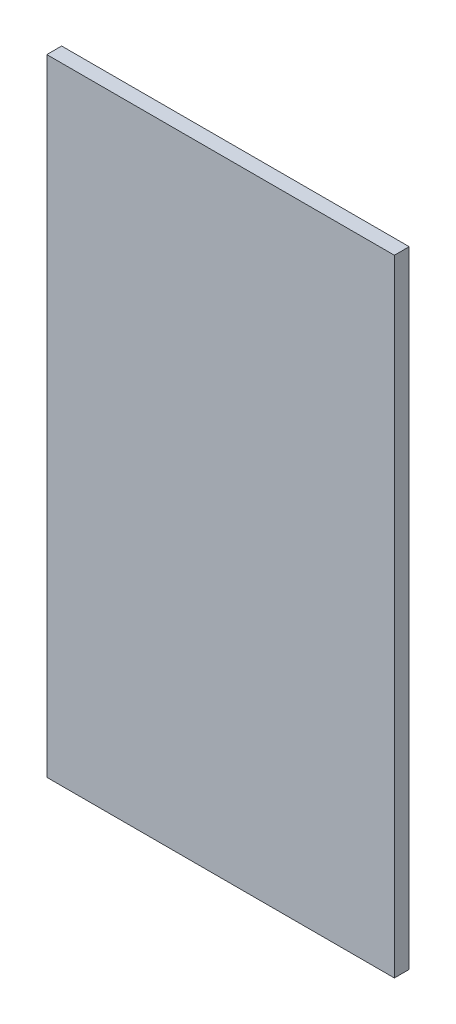
ISO-10303-21;
HEADER;
FILE_DESCRIPTION(('STEP AP214'),'2;1');
FILE_NAME('part.step','',(''),(''),'','','');
FILE_SCHEMA(('AUTOMOTIVE_DESIGN { 1 0 10303 214 1 1 1 1 }'));
ENDSEC;
DATA;
#1=APPLICATION_CONTEXT('core data for automotive mechanical design processes');
#2=APPLICATION_PROTOCOL_DEFINITION('international standard','automotive_design',2000,#1);
#3=PRODUCT_CONTEXT('',#1,'mechanical');
#4=PRODUCT('Part','Part','',(#3));
#5=PRODUCT_RELATED_PRODUCT_CATEGORY('part','',(#4));
#6=PRODUCT_DEFINITION_FORMATION('','',#4);
#7=PRODUCT_DEFINITION_CONTEXT('part definition',#1,'design');
#8=PRODUCT_DEFINITION('design','',#6,#7);
#9=PRODUCT_DEFINITION_SHAPE('','',#8);
#10=(LENGTH_UNIT() NAMED_UNIT(*) SI_UNIT(.MILLI.,.METRE.));
#11=(NAMED_UNIT(*) PLANE_ANGLE_UNIT() SI_UNIT($,.RADIAN.));
#12=(NAMED_UNIT(*) SI_UNIT($,.STERADIAN.) SOLID_ANGLE_UNIT());
#13=UNCERTAINTY_MEASURE_WITH_UNIT(LENGTH_MEASURE(1.E-05),#10,'distance_accuracy_value','');
#14=(GEOMETRIC_REPRESENTATION_CONTEXT(3) GLOBAL_UNCERTAINTY_ASSIGNED_CONTEXT((#13)) GLOBAL_UNIT_ASSIGNED_CONTEXT((#10,
#11,#12)) REPRESENTATION_CONTEXT('',''));
#15=CARTESIAN_POINT('',(0.,0.,0.));
#16=DIRECTION('',(0.,0.,1.));
#17=DIRECTION('',(1.,0.,0.));
#18=AXIS2_PLACEMENT_3D('',#15,#16,#17);
#19=CARTESIAN_POINT('',(105.5,-190.,9.));
#20=DIRECTION('',(-1.,0.,0.));
#21=DIRECTION('',(0.,0.,1.));
#22=AXIS2_PLACEMENT_3D('',#19,#20,#21);
#23=PLANE('',#22);
#24=DIRECTION('',(0.,1.,0.));
#25=VECTOR('',#24,1.);
#26=CARTESIAN_POINT('',(105.5,-190.,0.));
#27=LINE('',#26,#25);
#28=CARTESIAN_POINT('',(105.5,-190.,0.));
#29=VERTEX_POINT('',#28);
#30=CARTESIAN_POINT('',(105.5,190.,0.));
#31=VERTEX_POINT('',#30);
#32=EDGE_CURVE('E100',#29,#31,#27,.T.);
#33=ORIENTED_EDGE('',*,*,#32,.T.);
#34=DIRECTION('',(0.,0.,-1.));
#35=VECTOR('',#34,1.);
#36=CARTESIAN_POINT('',(105.5,190.,9.));
#37=LINE('',#36,#35);
#38=CARTESIAN_POINT('',(105.5,190.,9.));
#39=VERTEX_POINT('',#38);
#40=EDGE_CURVE('E11',#39,#31,#37,.T.);
#41=ORIENTED_EDGE('',*,*,#40,.F.);
#42=DIRECTION('',(0.,1.,0.));
#43=VECTOR('',#42,1.);
#44=CARTESIAN_POINT('',(105.5,-190.,9.));
#45=LINE('',#44,#43);
#46=CARTESIAN_POINT('',(105.5,-190.,9.));
#47=VERTEX_POINT('',#46);
#48=EDGE_CURVE('E88',#47,#39,#45,.T.);
#49=ORIENTED_EDGE('',*,*,#48,.F.);
#50=DIRECTION('',(0.,0.,-1.));
#51=VECTOR('',#50,1.);
#52=CARTESIAN_POINT('',(105.5,-190.,9.));
#53=LINE('',#52,#51);
#54=EDGE_CURVE('E96',#47,#29,#53,.T.);
#55=ORIENTED_EDGE('',*,*,#54,.T.);
#56=EDGE_LOOP('',(#33,#41,#49,#55));
#57=FACE_BOUND('',#56,.T.);
#58=ADVANCED_FACE('F37',(#57),#23,.F.);
#59=CARTESIAN_POINT('',(-105.5,190.,9.));
#60=DIRECTION('',(0.,-1.,0.));
#61=DIRECTION('',(0.,0.,-1.));
#62=AXIS2_PLACEMENT_3D('',#59,#60,#61);
#63=PLANE('',#62);
#64=DIRECTION('',(-1.,0.,0.));
#65=VECTOR('',#64,1.);
#66=CARTESIAN_POINT('',(-105.5,190.,0.));
#67=LINE('',#66,#65);
#68=CARTESIAN_POINT('',(-105.5,190.,0.));
#69=VERTEX_POINT('',#68);
#70=EDGE_CURVE('E92',#31,#69,#67,.T.);
#71=ORIENTED_EDGE('',*,*,#70,.T.);
#72=DIRECTION('',(0.,0.,-1.));
#73=VECTOR('',#72,1.);
#74=CARTESIAN_POINT('',(-105.5,190.,9.));
#75=LINE('',#74,#73);
#76=CARTESIAN_POINT('',(-105.5,190.,9.));
#77=VERTEX_POINT('',#76);
#78=EDGE_CURVE('E45',#77,#69,#75,.T.);
#79=ORIENTED_EDGE('',*,*,#78,.F.);
#80=DIRECTION('',(-1.,0.,0.));
#81=VECTOR('',#80,1.);
#82=CARTESIAN_POINT('',(-105.5,190.,9.));
#83=LINE('',#82,#81);
#84=EDGE_CURVE('E83',#39,#77,#83,.T.);
#85=ORIENTED_EDGE('',*,*,#84,.F.);
#86=ORIENTED_EDGE('',*,*,#40,.T.);
#87=EDGE_LOOP('',(#71,#79,#85,#86));
#88=FACE_BOUND('',#87,.T.);
#89=ADVANCED_FACE('F91',(#88),#63,.F.);
#90=CARTESIAN_POINT('',(-105.5,-190.,9.));
#91=DIRECTION('',(1.,0.,0.));
#92=DIRECTION('',(0.,0.,-1.));
#93=AXIS2_PLACEMENT_3D('',#90,#91,#92);
#94=PLANE('',#93);
#95=DIRECTION('',(0.,-1.,0.));
#96=VECTOR('',#95,1.);
#97=CARTESIAN_POINT('',(-105.5,-190.,0.));
#98=LINE('',#97,#96);
#99=CARTESIAN_POINT('',(-105.5,-190.,0.));
#100=VERTEX_POINT('',#99);
#101=EDGE_CURVE('E70',#69,#100,#98,.T.);
#102=ORIENTED_EDGE('',*,*,#101,.T.);
#103=DIRECTION('',(0.,0.,-1.));
#104=VECTOR('',#103,1.);
#105=CARTESIAN_POINT('',(-105.5,-190.,9.));
#106=LINE('',#105,#104);
#107=CARTESIAN_POINT('',(-105.5,-190.,9.));
#108=VERTEX_POINT('',#107);
#109=EDGE_CURVE('E93',#108,#100,#106,.T.);
#110=ORIENTED_EDGE('',*,*,#109,.F.);
#111=DIRECTION('',(0.,-1.,0.));
#112=VECTOR('',#111,1.);
#113=CARTESIAN_POINT('',(-105.5,-190.,9.));
#114=LINE('',#113,#112);
#115=EDGE_CURVE('E86',#77,#108,#114,.T.);
#116=ORIENTED_EDGE('',*,*,#115,.F.);
#117=ORIENTED_EDGE('',*,*,#78,.T.);
#118=EDGE_LOOP('',(#102,#110,#116,#117));
#119=FACE_BOUND('',#118,.T.);
#120=ADVANCED_FACE('F94',(#119),#94,.F.);
#121=CARTESIAN_POINT('',(-105.5,-190.,9.));
#122=DIRECTION('',(0.,1.,0.));
#123=DIRECTION('',(0.,0.,1.));
#124=AXIS2_PLACEMENT_3D('',#121,#122,#123);
#125=PLANE('',#124);
#126=DIRECTION('',(1.,0.,0.));
#127=VECTOR('',#126,1.);
#128=CARTESIAN_POINT('',(-105.5,-190.,0.));
#129=LINE('',#128,#127);
#130=EDGE_CURVE('E76',#100,#29,#129,.T.);
#131=ORIENTED_EDGE('',*,*,#130,.T.);
#132=ORIENTED_EDGE('',*,*,#54,.F.);
#133=DIRECTION('',(1.,0.,0.));
#134=VECTOR('',#133,1.);
#135=CARTESIAN_POINT('',(-105.5,-190.,9.));
#136=LINE('',#135,#134);
#137=EDGE_CURVE('E53',#108,#47,#136,.T.);
#138=ORIENTED_EDGE('',*,*,#137,.F.);
#139=ORIENTED_EDGE('',*,*,#109,.T.);
#140=EDGE_LOOP('',(#131,#132,#138,#139));
#141=FACE_BOUND('',#140,.T.);
#142=ADVANCED_FACE('F107',(#141),#125,.F.);
#143=CARTESIAN_POINT('',(0.,0.,9.));
#144=DIRECTION('',(0.,0.,-1.));
#145=DIRECTION('',(-1.,0.,0.));
#146=AXIS2_PLACEMENT_3D('',#143,#144,#145);
#147=PLANE('',#146);
#148=ORIENTED_EDGE('',*,*,#48,.T.);
#149=ORIENTED_EDGE('',*,*,#84,.T.);
#150=ORIENTED_EDGE('',*,*,#115,.T.);
#151=ORIENTED_EDGE('',*,*,#137,.T.);
#152=EDGE_LOOP('',(#148,#149,#150,#151));
#153=FACE_BOUND('',#152,.T.);
#154=ADVANCED_FACE('F84',(#153),#147,.F.);
#155=CARTESIAN_POINT('',(0.,0.,0.));
#156=DIRECTION('',(0.,0.,-1.));
#157=DIRECTION('',(-1.,0.,0.));
#158=AXIS2_PLACEMENT_3D('',#155,#156,#157);
#159=PLANE('',#158);
#160=ORIENTED_EDGE('',*,*,#32,.F.);
#161=ORIENTED_EDGE('',*,*,#130,.F.);
#162=ORIENTED_EDGE('',*,*,#101,.F.);
#163=ORIENTED_EDGE('',*,*,#70,.F.);
#164=EDGE_LOOP('',(#160,#161,#162,#163));
#165=FACE_BOUND('',#164,.T.);
#166=ADVANCED_FACE('F110',(#165),#159,.T.);
#167=CLOSED_SHELL('',(#58,#89,#120,#142,#154,#166));
#168=MANIFOLD_SOLID_BREP('B2',#167);
#169=ADVANCED_BREP_SHAPE_REPRESENTATION('',(#18,#168),#14);
#170=SHAPE_DEFINITION_REPRESENTATION(#9,#169);
ENDSEC;
END-ISO-10303-21;
